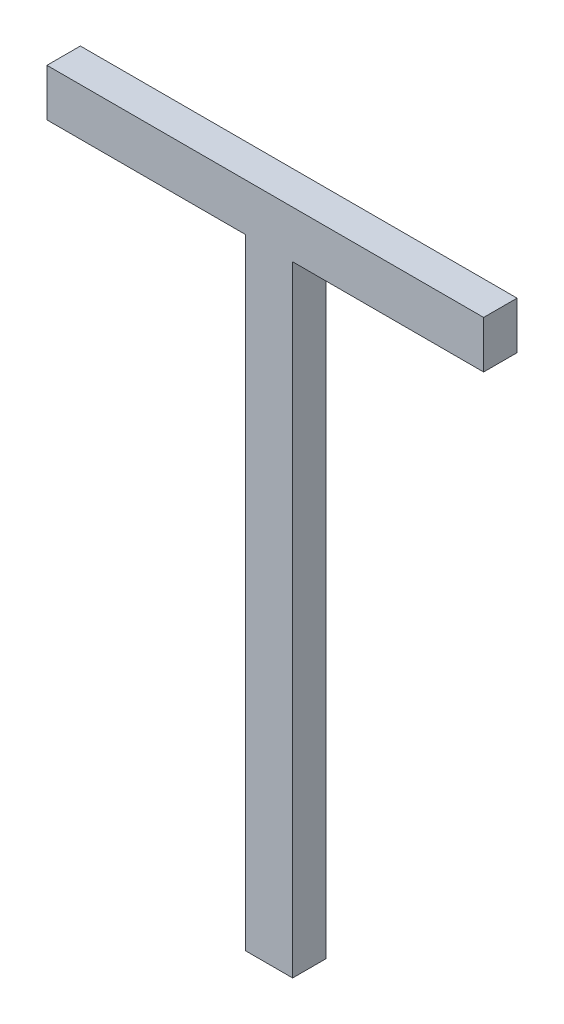
ISO-10303-21;
HEADER;
FILE_DESCRIPTION(('STEP AP214'),'2;1');
FILE_NAME('part.step','',(''),(''),'','','');
FILE_SCHEMA(('AUTOMOTIVE_DESIGN { 1 0 10303 214 1 1 1 1 }'));
ENDSEC;
DATA;
#1=APPLICATION_CONTEXT('core data for automotive mechanical design processes');
#2=APPLICATION_PROTOCOL_DEFINITION('international standard','automotive_design',2000,#1);
#3=PRODUCT_CONTEXT('',#1,'mechanical');
#4=PRODUCT('Part','Part','',(#3));
#5=PRODUCT_RELATED_PRODUCT_CATEGORY('part','',(#4));
#6=PRODUCT_DEFINITION_FORMATION('','',#4);
#7=PRODUCT_DEFINITION_CONTEXT('part definition',#1,'design');
#8=PRODUCT_DEFINITION('design','',#6,#7);
#9=PRODUCT_DEFINITION_SHAPE('','',#8);
#10=(LENGTH_UNIT() NAMED_UNIT(*) SI_UNIT(.MILLI.,.METRE.));
#11=(NAMED_UNIT(*) PLANE_ANGLE_UNIT() SI_UNIT($,.RADIAN.));
#12=(NAMED_UNIT(*) SI_UNIT($,.STERADIAN.) SOLID_ANGLE_UNIT());
#13=UNCERTAINTY_MEASURE_WITH_UNIT(LENGTH_MEASURE(1.E-05),#10,'distance_accuracy_value','');
#14=(GEOMETRIC_REPRESENTATION_CONTEXT(3) GLOBAL_UNCERTAINTY_ASSIGNED_CONTEXT((#13)) GLOBAL_UNIT_ASSIGNED_CONTEXT((#10,
#11,#12)) REPRESENTATION_CONTEXT('',''));
#15=CARTESIAN_POINT('',(0.,0.,0.));
#16=DIRECTION('',(0.,0.,1.));
#17=DIRECTION('',(1.,0.,0.));
#18=AXIS2_PLACEMENT_3D('',#15,#16,#17);
#19=CARTESIAN_POINT('',(67.1978125064903,67.6349331167411,-39.1));
#20=DIRECTION('',(0.,0.,1.));
#21=DIRECTION('',(1.,0.,0.));
#22=AXIS2_PLACEMENT_3D('',#19,#20,#21);
#23=PLANE('',#22);
#24=DIRECTION('',(1.,0.,0.));
#25=VECTOR('',#24,1.);
#26=CARTESIAN_POINT('',(67.1978125064903,67.7764032970511,-39.1));
#27=LINE('',#26,#25);
#28=CARTESIAN_POINT('',(68.5043312304903,67.7764032970511,-39.1));
#29=VERTEX_POINT('',#28);
#30=CARTESIAN_POINT('',(67.1978125064903,67.7764032970511,-39.1));
#31=VERTEX_POINT('',#30);
#32=EDGE_CURVE('E95',#29,#31,#27,.F.);
#33=ORIENTED_EDGE('',*,*,#32,.F.);
#34=DIRECTION('',(0.,1.,0.));
#35=VECTOR('',#34,1.);
#36=CARTESIAN_POINT('',(68.5043312304903,67.6349331167411,-39.1));
#37=LINE('',#36,#35);
#38=CARTESIAN_POINT('',(68.5043312304903,67.6349331167411,-39.1));
#39=VERTEX_POINT('',#38);
#40=EDGE_CURVE('E78',#39,#29,#37,.T.);
#41=ORIENTED_EDGE('',*,*,#40,.F.);
#42=DIRECTION('',(1.,0.,0.));
#43=VECTOR('',#42,1.);
#44=CARTESIAN_POINT('',(67.1978125064903,67.6349331167411,-39.1));
#45=LINE('',#44,#43);
#46=CARTESIAN_POINT('',(67.9329026589903,67.6349331167411,-39.1));
#47=VERTEX_POINT('',#46);
#48=EDGE_CURVE('E20',#47,#39,#45,.T.);
#49=ORIENTED_EDGE('',*,*,#48,.F.);
#50=DIRECTION('',(0.,1.,0.));
#51=VECTOR('',#50,1.);
#52=CARTESIAN_POINT('',(67.9329026589903,65.7791772221511,-39.1));
#53=LINE('',#52,#51);
#54=CARTESIAN_POINT('',(67.9329026589903,65.7791772221511,-39.1));
#55=VERTEX_POINT('',#54);
#56=EDGE_CURVE('E117',#47,#55,#53,.F.);
#57=ORIENTED_EDGE('',*,*,#56,.T.);
#58=DIRECTION('',(1.,0.,0.));
#59=VECTOR('',#58,1.);
#60=CARTESIAN_POINT('',(67.7914324786903,65.7791772221511,-39.1));
#61=LINE('',#60,#59);
#62=CARTESIAN_POINT('',(67.7914324786903,65.7791772221511,-39.1));
#63=VERTEX_POINT('',#62);
#64=EDGE_CURVE('E112',#55,#63,#61,.F.);
#65=ORIENTED_EDGE('',*,*,#64,.T.);
#66=DIRECTION('',(0.,1.,0.));
#67=VECTOR('',#66,1.);
#68=CARTESIAN_POINT('',(67.7914324786903,67.6349331167411,-39.1));
#69=LINE('',#68,#67);
#70=CARTESIAN_POINT('',(67.7914324786903,67.6349331167411,-39.1));
#71=VERTEX_POINT('',#70);
#72=EDGE_CURVE('E107',#63,#71,#69,.T.);
#73=ORIENTED_EDGE('',*,*,#72,.T.);
#74=DIRECTION('',(1.,0.,0.));
#75=VECTOR('',#74,1.);
#76=CARTESIAN_POINT('',(67.1978125064903,67.6349331167411,-39.1));
#77=LINE('',#76,#75);
#78=CARTESIAN_POINT('',(67.1978125064903,67.6349331167411,-39.1));
#79=VERTEX_POINT('',#78);
#80=EDGE_CURVE('E102',#71,#79,#77,.F.);
#81=ORIENTED_EDGE('',*,*,#80,.T.);
#82=DIRECTION('',(0.,1.,0.));
#83=VECTOR('',#82,1.);
#84=CARTESIAN_POINT('',(67.1978125064903,67.7764032970511,-39.1));
#85=LINE('',#84,#83);
#86=EDGE_CURVE('E96',#79,#31,#85,.T.);
#87=ORIENTED_EDGE('',*,*,#86,.T.);
#88=EDGE_LOOP('',(#33,#41,#49,#57,#65,#73,#81,#87));
#89=FACE_BOUND('',#88,.T.);
#90=ADVANCED_FACE('F17',(#89),#23,.F.);
#91=CARTESIAN_POINT('',(67.1978125064903,67.7764032970511,-39.));
#92=DIRECTION('',(1.,0.,0.));
#93=DIRECTION('',(0.,0.,-1.));
#94=AXIS2_PLACEMENT_3D('',#91,#92,#93);
#95=PLANE('',#94);
#96=DIRECTION('',(0.,0.,1.));
#97=VECTOR('',#96,1.);
#98=CARTESIAN_POINT('',(67.1978125064903,67.6349331167411,-39.));
#99=LINE('',#98,#97);
#100=CARTESIAN_POINT('',(67.1978125064903,67.6349331167411,-39.));
#101=VERTEX_POINT('',#100);
#102=EDGE_CURVE('E100',#79,#101,#99,.T.);
#103=ORIENTED_EDGE('',*,*,#102,.T.);
#104=DIRECTION('',(0.,1.,0.));
#105=VECTOR('',#104,1.);
#106=CARTESIAN_POINT('',(67.1978125064903,67.6349331167411,-39.));
#107=LINE('',#106,#105);
#108=CARTESIAN_POINT('',(67.1978125064903,67.7764032970511,-39.));
#109=VERTEX_POINT('',#108);
#110=EDGE_CURVE('E124',#109,#101,#107,.F.);
#111=ORIENTED_EDGE('',*,*,#110,.F.);
#112=DIRECTION('',(0.,0.,-1.));
#113=VECTOR('',#112,1.);
#114=CARTESIAN_POINT('',(67.1978125064903,67.7764032970511,-39.));
#115=LINE('',#114,#113);
#116=EDGE_CURVE('E121',#109,#31,#115,.T.);
#117=ORIENTED_EDGE('',*,*,#116,.T.);
#118=ORIENTED_EDGE('',*,*,#86,.F.);
#119=EDGE_LOOP('',(#103,#111,#117,#118));
#120=FACE_BOUND('',#119,.T.);
#121=ADVANCED_FACE('F161',(#120),#95,.F.);
#122=CARTESIAN_POINT('',(67.1978125064903,67.6349331167411,-39.));
#123=DIRECTION('',(0.,1.,0.));
#124=DIRECTION('',(0.,0.,1.));
#125=AXIS2_PLACEMENT_3D('',#122,#123,#124);
#126=PLANE('',#125);
#127=DIRECTION('',(0.,0.,-1.));
#128=VECTOR('',#127,1.);
#129=CARTESIAN_POINT('',(67.7914324786903,67.6349331167411,-39.));
#130=LINE('',#129,#128);
#131=CARTESIAN_POINT('',(67.7914324786903,67.6349331167411,-39.));
#132=VERTEX_POINT('',#131);
#133=EDGE_CURVE('E105',#71,#132,#130,.F.);
#134=ORIENTED_EDGE('',*,*,#133,.T.);
#135=DIRECTION('',(1.,0.,0.));
#136=VECTOR('',#135,1.);
#137=CARTESIAN_POINT('',(67.1978125064903,67.6349331167411,-39.));
#138=LINE('',#137,#136);
#139=EDGE_CURVE('E127',#101,#132,#138,.T.);
#140=ORIENTED_EDGE('',*,*,#139,.F.);
#141=ORIENTED_EDGE('',*,*,#102,.F.);
#142=ORIENTED_EDGE('',*,*,#80,.F.);
#143=EDGE_LOOP('',(#134,#140,#141,#142));
#144=FACE_BOUND('',#143,.T.);
#145=ADVANCED_FACE('F157',(#144),#126,.F.);
#146=CARTESIAN_POINT('',(67.7914324786903,67.6349331167411,-39.));
#147=DIRECTION('',(1.,0.,0.));
#148=DIRECTION('',(0.,0.,-1.));
#149=AXIS2_PLACEMENT_3D('',#146,#147,#148);
#150=PLANE('',#149);
#151=DIRECTION('',(0.,0.,1.));
#152=VECTOR('',#151,1.);
#153=CARTESIAN_POINT('',(67.7914324786903,65.7791772221511,-39.));
#154=LINE('',#153,#152);
#155=CARTESIAN_POINT('',(67.7914324786903,65.7791772221511,-39.));
#156=VERTEX_POINT('',#155);
#157=EDGE_CURVE('E110',#63,#156,#154,.T.);
#158=ORIENTED_EDGE('',*,*,#157,.T.);
#159=DIRECTION('',(0.,1.,0.));
#160=VECTOR('',#159,1.);
#161=CARTESIAN_POINT('',(67.7914324786903,67.6349331167411,-39.));
#162=LINE('',#161,#160);
#163=EDGE_CURVE('E130',#132,#156,#162,.F.);
#164=ORIENTED_EDGE('',*,*,#163,.F.);
#165=ORIENTED_EDGE('',*,*,#133,.F.);
#166=ORIENTED_EDGE('',*,*,#72,.F.);
#167=EDGE_LOOP('',(#158,#164,#165,#166));
#168=FACE_BOUND('',#167,.T.);
#169=ADVANCED_FACE('F154',(#168),#150,.F.);
#170=CARTESIAN_POINT('',(67.7914324786903,65.7791772221511,-39.));
#171=DIRECTION('',(0.,1.,0.));
#172=DIRECTION('',(0.,0.,1.));
#173=AXIS2_PLACEMENT_3D('',#170,#171,#172);
#174=PLANE('',#173);
#175=DIRECTION('',(0.,0.,1.));
#176=VECTOR('',#175,1.);
#177=CARTESIAN_POINT('',(67.9329026589903,65.7791772221511,-39.));
#178=LINE('',#177,#176);
#179=CARTESIAN_POINT('',(67.9329026589903,65.7791772221511,-39.));
#180=VERTEX_POINT('',#179);
#181=EDGE_CURVE('E115',#55,#180,#178,.T.);
#182=ORIENTED_EDGE('',*,*,#181,.T.);
#183=DIRECTION('',(1.,0.,0.));
#184=VECTOR('',#183,1.);
#185=CARTESIAN_POINT('',(67.1978125064903,65.7791772221511,-39.));
#186=LINE('',#185,#184);
#187=EDGE_CURVE('E133',#156,#180,#186,.T.);
#188=ORIENTED_EDGE('',*,*,#187,.F.);
#189=ORIENTED_EDGE('',*,*,#157,.F.);
#190=ORIENTED_EDGE('',*,*,#64,.F.);
#191=EDGE_LOOP('',(#182,#188,#189,#190));
#192=FACE_BOUND('',#191,.T.);
#193=ADVANCED_FACE('F151',(#192),#174,.F.);
#194=CARTESIAN_POINT('',(67.9329026589903,65.7791772221511,-39.));
#195=DIRECTION('',(-1.,0.,0.));
#196=DIRECTION('',(0.,0.,1.));
#197=AXIS2_PLACEMENT_3D('',#194,#195,#196);
#198=PLANE('',#197);
#199=DIRECTION('',(0.,0.,1.));
#200=VECTOR('',#199,1.);
#201=CARTESIAN_POINT('',(67.9329026589903,67.6349331167411,-39.));
#202=LINE('',#201,#200);
#203=CARTESIAN_POINT('',(67.9329026589903,67.6349331167411,-39.));
#204=VERTEX_POINT('',#203);
#205=EDGE_CURVE('E85',#47,#204,#202,.T.);
#206=ORIENTED_EDGE('',*,*,#205,.T.);
#207=DIRECTION('',(0.,1.,0.));
#208=VECTOR('',#207,1.);
#209=CARTESIAN_POINT('',(67.9329026589903,67.6349331167411,-39.));
#210=LINE('',#209,#208);
#211=EDGE_CURVE('E136',#180,#204,#210,.T.);
#212=ORIENTED_EDGE('',*,*,#211,.F.);
#213=ORIENTED_EDGE('',*,*,#181,.F.);
#214=ORIENTED_EDGE('',*,*,#56,.F.);
#215=EDGE_LOOP('',(#206,#212,#213,#214));
#216=FACE_BOUND('',#215,.T.);
#217=ADVANCED_FACE('F147',(#216),#198,.F.);
#218=CARTESIAN_POINT('',(67.9329026589903,67.6349331167411,-39.));
#219=DIRECTION('',(0.,1.,0.));
#220=DIRECTION('',(0.,0.,1.));
#221=AXIS2_PLACEMENT_3D('',#218,#219,#220);
#222=PLANE('',#221);
#223=DIRECTION('',(0.,0.,1.));
#224=VECTOR('',#223,1.);
#225=CARTESIAN_POINT('',(68.5043312304903,67.6349331167411,-39.));
#226=LINE('',#225,#224);
#227=CARTESIAN_POINT('',(68.5043312304903,67.6349331167411,-39.));
#228=VERTEX_POINT('',#227);
#229=EDGE_CURVE('E84',#39,#228,#226,.T.);
#230=ORIENTED_EDGE('',*,*,#229,.T.);
#231=DIRECTION('',(1.,0.,0.));
#232=VECTOR('',#231,1.);
#233=CARTESIAN_POINT('',(67.1978125064903,67.6349331167411,-39.));
#234=LINE('',#233,#232);
#235=EDGE_CURVE('E139',#204,#228,#234,.T.);
#236=ORIENTED_EDGE('',*,*,#235,.F.);
#237=ORIENTED_EDGE('',*,*,#205,.F.);
#238=ORIENTED_EDGE('',*,*,#48,.T.);
#239=EDGE_LOOP('',(#230,#236,#237,#238));
#240=FACE_BOUND('',#239,.T.);
#241=ADVANCED_FACE('F82',(#240),#222,.F.);
#242=CARTESIAN_POINT('',(68.5043312304903,67.6349331167411,-39.));
#243=DIRECTION('',(-1.,0.,0.));
#244=DIRECTION('',(0.,0.,1.));
#245=AXIS2_PLACEMENT_3D('',#242,#243,#244);
#246=PLANE('',#245);
#247=DIRECTION('',(0.,0.,-1.));
#248=VECTOR('',#247,1.);
#249=CARTESIAN_POINT('',(68.5043312304903,67.7764032970511,-39.));
#250=LINE('',#249,#248);
#251=CARTESIAN_POINT('',(68.5043312304903,67.7764032970511,-39.));
#252=VERTEX_POINT('',#251);
#253=EDGE_CURVE('E35',#29,#252,#250,.F.);
#254=ORIENTED_EDGE('',*,*,#253,.T.);
#255=DIRECTION('',(0.,1.,0.));
#256=VECTOR('',#255,1.);
#257=CARTESIAN_POINT('',(68.5043312304903,67.6349331167411,-39.));
#258=LINE('',#257,#256);
#259=EDGE_CURVE('E26',#228,#252,#258,.T.);
#260=ORIENTED_EDGE('',*,*,#259,.F.);
#261=ORIENTED_EDGE('',*,*,#229,.F.);
#262=ORIENTED_EDGE('',*,*,#40,.T.);
#263=EDGE_LOOP('',(#254,#260,#261,#262));
#264=FACE_BOUND('',#263,.T.);
#265=ADVANCED_FACE('F89',(#264),#246,.F.);
#266=CARTESIAN_POINT('',(68.5043312304903,67.7764032970511,-39.));
#267=DIRECTION('',(0.,-1.,0.));
#268=DIRECTION('',(0.,0.,-1.));
#269=AXIS2_PLACEMENT_3D('',#266,#267,#268);
#270=PLANE('',#269);
#271=ORIENTED_EDGE('',*,*,#116,.F.);
#272=DIRECTION('',(1.,0.,0.));
#273=VECTOR('',#272,1.);
#274=CARTESIAN_POINT('',(67.1978125064903,67.7764032970511,-39.));
#275=LINE('',#274,#273);
#276=EDGE_CURVE('E11',#252,#109,#275,.F.);
#277=ORIENTED_EDGE('',*,*,#276,.F.);
#278=ORIENTED_EDGE('',*,*,#253,.F.);
#279=ORIENTED_EDGE('',*,*,#32,.T.);
#280=EDGE_LOOP('',(#271,#277,#278,#279));
#281=FACE_BOUND('',#280,.T.);
#282=ADVANCED_FACE('F163',(#281),#270,.F.);
#283=CARTESIAN_POINT('',(67.1978125064903,67.6349331167411,-39.));
#284=DIRECTION('',(0.,0.,1.));
#285=DIRECTION('',(1.,0.,0.));
#286=AXIS2_PLACEMENT_3D('',#283,#284,#285);
#287=PLANE('',#286);
#288=ORIENTED_EDGE('',*,*,#259,.T.);
#289=ORIENTED_EDGE('',*,*,#276,.T.);
#290=ORIENTED_EDGE('',*,*,#110,.T.);
#291=ORIENTED_EDGE('',*,*,#139,.T.);
#292=ORIENTED_EDGE('',*,*,#163,.T.);
#293=ORIENTED_EDGE('',*,*,#187,.T.);
#294=ORIENTED_EDGE('',*,*,#211,.T.);
#295=ORIENTED_EDGE('',*,*,#235,.T.);
#296=EDGE_LOOP('',(#288,#289,#290,#291,#292,#293,#294,#295));
#297=FACE_BOUND('',#296,.T.);
#298=ADVANCED_FACE('F142',(#297),#287,.T.);
#299=CLOSED_SHELL('',(#90,#121,#145,#169,#193,#217,#241,#265,#282,#298));
#300=MANIFOLD_SOLID_BREP('B1',#299);
#301=ADVANCED_BREP_SHAPE_REPRESENTATION('',(#18,#300),#14);
#302=SHAPE_DEFINITION_REPRESENTATION(#9,#301);
ENDSEC;
END-ISO-10303-21;
